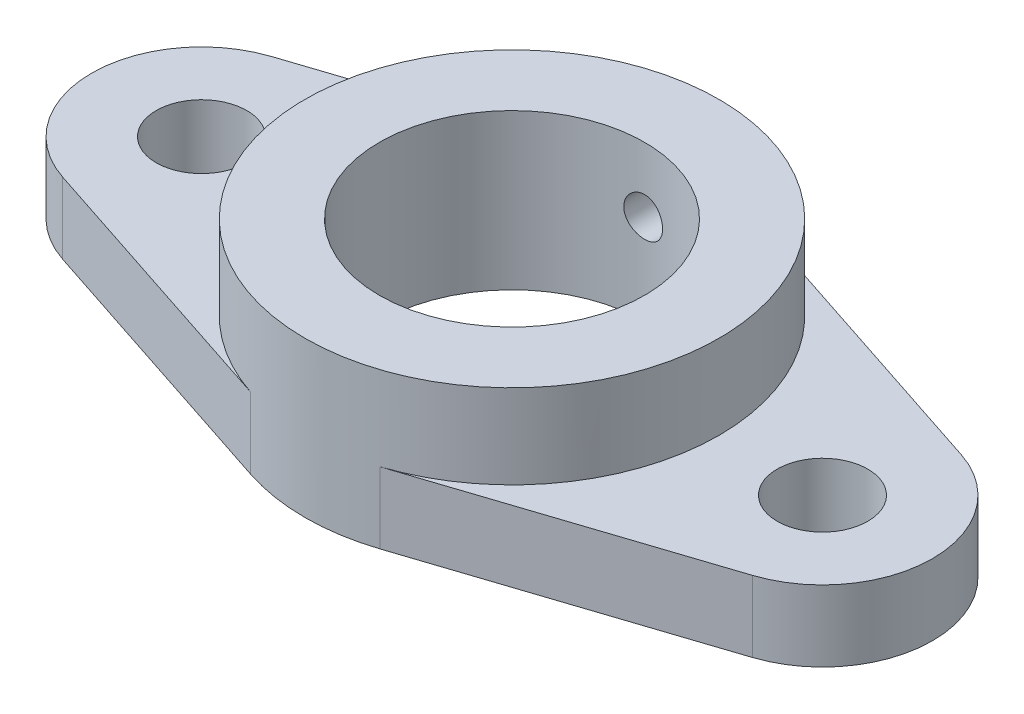
ISO-10303-21;
HEADER;
FILE_DESCRIPTION(('STEP AP214'),'2;1');
FILE_NAME('part.step','',(''),(''),'','','');
FILE_SCHEMA(('AUTOMOTIVE_DESIGN { 1 0 10303 214 1 1 1 1 }'));
ENDSEC;
DATA;
#1=APPLICATION_CONTEXT('core data for automotive mechanical design processes');
#2=APPLICATION_PROTOCOL_DEFINITION('international standard','automotive_design',2000,#1);
#3=PRODUCT_CONTEXT('',#1,'mechanical');
#4=PRODUCT('Part','Part','',(#3));
#5=PRODUCT_RELATED_PRODUCT_CATEGORY('part','',(#4));
#6=PRODUCT_DEFINITION_FORMATION('','',#4);
#7=PRODUCT_DEFINITION_CONTEXT('part definition',#1,'design');
#8=PRODUCT_DEFINITION('design','',#6,#7);
#9=PRODUCT_DEFINITION_SHAPE('','',#8);
#10=(LENGTH_UNIT() NAMED_UNIT(*) SI_UNIT(.MILLI.,.METRE.));
#11=(NAMED_UNIT(*) PLANE_ANGLE_UNIT() SI_UNIT($,.RADIAN.));
#12=(NAMED_UNIT(*) SI_UNIT($,.STERADIAN.) SOLID_ANGLE_UNIT());
#13=UNCERTAINTY_MEASURE_WITH_UNIT(LENGTH_MEASURE(1.E-05),#10,'distance_accuracy_value','');
#14=(GEOMETRIC_REPRESENTATION_CONTEXT(3) GLOBAL_UNCERTAINTY_ASSIGNED_CONTEXT((#13)) GLOBAL_UNIT_ASSIGNED_CONTEXT((#10,
#11,#12)) REPRESENTATION_CONTEXT('',''));
#15=CARTESIAN_POINT('',(0.,0.,0.));
#16=DIRECTION('',(0.,0.,1.));
#17=DIRECTION('',(1.,0.,0.));
#18=AXIS2_PLACEMENT_3D('',#15,#16,#17);
#19=CARTESIAN_POINT('',(-48.,11.,0.));
#20=DIRECTION('',(0.,1.,0.));
#21=DIRECTION('',(0.,0.,1.));
#22=AXIS2_PLACEMENT_3D('',#19,#20,#21);
#23=PLANE('',#22);
#24=CARTESIAN_POINT('',(-48.,11.,0.));
#25=DIRECTION('',(0.,1.,0.));
#26=DIRECTION('',(0.,0.,1.));
#27=AXIS2_PLACEMENT_3D('',#24,#25,#26);
#28=CIRCLE('',#27,7.);
#29=CARTESIAN_POINT('',(-48.,11.,7.));
#30=VERTEX_POINT('',#29);
#31=EDGE_CURVE('E156',#30,#30,#28,.T.);
#32=ORIENTED_EDGE('',*,*,#31,.F.);
#33=EDGE_LOOP('',(#32));
#34=FACE_BOUND('',#33,.T.);
#35=DIRECTION('',(0.949917759598166,0.,0.3125));
#36=VECTOR('',#35,1.);
#37=CARTESIAN_POINT('',(-53.3125,11.,16.1486019131688));
#38=LINE('',#37,#36);
#39=CARTESIAN_POINT('',(-53.3125,11.,16.1486019131688));
#40=VERTEX_POINT('',#39);
#41=CARTESIAN_POINT('',(-10.,11.,30.3973683071413));
#42=VERTEX_POINT('',#41);
#43=EDGE_CURVE('E103',#40,#42,#38,.T.);
#44=ORIENTED_EDGE('',*,*,#43,.T.);
#45=CARTESIAN_POINT('',(0.,11.,0.));
#46=DIRECTION('',(0.,1.,0.));
#47=DIRECTION('',(0.,0.,1.));
#48=AXIS2_PLACEMENT_3D('',#45,#46,#47);
#49=CIRCLE('',#48,32.);
#50=CARTESIAN_POINT('',(-9.99999999999999,11.,-30.3973683071413));
#51=VERTEX_POINT('',#50);
#52=EDGE_CURVE('E145',#42,#51,#49,.F.);
#53=ORIENTED_EDGE('',*,*,#52,.T.);
#54=DIRECTION('',(0.949917759598166,0.,-0.3125));
#55=VECTOR('',#54,1.);
#56=CARTESIAN_POINT('',(-53.3125,11.,-16.1486019131688));
#57=LINE('',#56,#55);
#58=CARTESIAN_POINT('',(-53.3125,11.,-16.1486019131688));
#59=VERTEX_POINT('',#58);
#60=EDGE_CURVE('E137',#59,#51,#57,.T.);
#61=ORIENTED_EDGE('',*,*,#60,.F.);
#62=CARTESIAN_POINT('',(-48.,11.,0.));
#63=DIRECTION('',(0.,1.,0.));
#64=DIRECTION('',(0.,0.,1.));
#65=AXIS2_PLACEMENT_3D('',#62,#63,#64);
#66=CIRCLE('',#65,17.);
#67=EDGE_CURVE('E172',#59,#40,#66,.T.);
#68=ORIENTED_EDGE('',*,*,#67,.T.);
#69=EDGE_LOOP('',(#44,#53,#61,#68));
#70=FACE_BOUND('',#69,.T.);
#71=ADVANCED_FACE('F39',(#34,#70),#23,.T.);
#72=CARTESIAN_POINT('',(48.,11.,0.));
#73=DIRECTION('',(0.,1.,0.));
#74=DIRECTION('',(0.,0.,1.));
#75=AXIS2_PLACEMENT_3D('',#72,#73,#74);
#76=CIRCLE('',#75,7.);
#77=CARTESIAN_POINT('',(48.,11.,7.));
#78=VERTEX_POINT('',#77);
#79=EDGE_CURVE('E165',#78,#78,#76,.T.);
#80=ORIENTED_EDGE('',*,*,#79,.F.);
#81=EDGE_LOOP('',(#80));
#82=FACE_BOUND('',#81,.T.);
#83=DIRECTION('',(0.949917759598166,0.,0.3125));
#84=VECTOR('',#83,1.);
#85=CARTESIAN_POINT('',(10.,11.,-30.3973683071413));
#86=LINE('',#85,#84);
#87=CARTESIAN_POINT('',(10.,11.,-30.3973683071413));
#88=VERTEX_POINT('',#87);
#89=CARTESIAN_POINT('',(53.3125,11.,-16.1486019131688));
#90=VERTEX_POINT('',#89);
#91=EDGE_CURVE('E120',#88,#90,#86,.T.);
#92=ORIENTED_EDGE('',*,*,#91,.F.);
#93=CARTESIAN_POINT('',(10.,11.,30.3973683071413));
#94=VERTEX_POINT('',#93);
#95=EDGE_CURVE('E132',#88,#94,#49,.F.);
#96=ORIENTED_EDGE('',*,*,#95,.T.);
#97=DIRECTION('',(0.949917759598166,0.,-0.3125));
#98=VECTOR('',#97,1.);
#99=CARTESIAN_POINT('',(10.,11.,30.3973683071413));
#100=LINE('',#99,#98);
#101=CARTESIAN_POINT('',(53.3125,11.,16.1486019131688));
#102=VERTEX_POINT('',#101);
#103=EDGE_CURVE('E178',#94,#102,#100,.T.);
#104=ORIENTED_EDGE('',*,*,#103,.T.);
#105=CARTESIAN_POINT('',(48.,11.,0.));
#106=DIRECTION('',(0.,1.,0.));
#107=DIRECTION('',(0.,0.,1.));
#108=AXIS2_PLACEMENT_3D('',#105,#106,#107);
#109=CIRCLE('',#108,17.);
#110=EDGE_CURVE('E134',#102,#90,#109,.T.);
#111=ORIENTED_EDGE('',*,*,#110,.T.);
#112=EDGE_LOOP('',(#92,#96,#104,#111));
#113=FACE_BOUND('',#112,.T.);
#114=ADVANCED_FACE('F131',(#82,#113),#23,.T.);
#115=CARTESIAN_POINT('',(-48.,11.,0.));
#116=DIRECTION('',(0.,-1.,0.));
#117=DIRECTION('',(0.,0.,-1.));
#118=AXIS2_PLACEMENT_3D('',#115,#116,#117);
#119=CYLINDRICAL_SURFACE('',#118,17.);
#120=CARTESIAN_POINT('',(-48.,0.,0.));
#121=DIRECTION('',(0.,1.,0.));
#122=DIRECTION('',(0.,0.,1.));
#123=AXIS2_PLACEMENT_3D('',#120,#121,#122);
#124=CIRCLE('',#123,17.);
#125=CARTESIAN_POINT('',(-53.3125,0.,-16.1486019131688));
#126=VERTEX_POINT('',#125);
#127=CARTESIAN_POINT('',(-53.3125,0.,16.1486019131688));
#128=VERTEX_POINT('',#127);
#129=EDGE_CURVE('E160',#126,#128,#124,.T.);
#130=ORIENTED_EDGE('',*,*,#129,.T.);
#131=DIRECTION('',(0.,-1.,0.));
#132=VECTOR('',#131,1.);
#133=CARTESIAN_POINT('',(-53.3125,11.,16.1486019131688));
#134=LINE('',#133,#132);
#135=EDGE_CURVE('E11',#40,#128,#134,.T.);
#136=ORIENTED_EDGE('',*,*,#135,.F.);
#137=ORIENTED_EDGE('',*,*,#67,.F.);
#138=DIRECTION('',(0.,-1.,0.));
#139=VECTOR('',#138,1.);
#140=CARTESIAN_POINT('',(-53.3125,11.,-16.1486019131688));
#141=LINE('',#140,#139);
#142=EDGE_CURVE('E63',#59,#126,#141,.T.);
#143=ORIENTED_EDGE('',*,*,#142,.T.);
#144=EDGE_LOOP('',(#130,#136,#137,#143));
#145=FACE_BOUND('',#144,.T.);
#146=ADVANCED_FACE('F41',(#145),#119,.T.);
#147=CARTESIAN_POINT('',(-53.3125,11.,16.1486019131688));
#148=DIRECTION('',(0.3125,0.,-0.949917759598167));
#149=DIRECTION('',(-0.949917759598167,0.,-0.3125));
#150=AXIS2_PLACEMENT_3D('',#147,#148,#149);
#151=PLANE('',#150);
#152=DIRECTION('',(0.949917759598166,0.,0.3125));
#153=VECTOR('',#152,1.);
#154=CARTESIAN_POINT('',(-53.3125,0.,16.1486019131688));
#155=LINE('',#154,#153);
#156=CARTESIAN_POINT('',(-10.,0.,30.3973683071413));
#157=VERTEX_POINT('',#156);
#158=EDGE_CURVE('E187',#128,#157,#155,.T.);
#159=ORIENTED_EDGE('',*,*,#158,.T.);
#160=DIRECTION('',(0.,-1.,0.));
#161=VECTOR('',#160,1.);
#162=CARTESIAN_POINT('',(-10.,11.,30.3973683071413));
#163=LINE('',#162,#161);
#164=EDGE_CURVE('E55',#42,#157,#163,.T.);
#165=ORIENTED_EDGE('',*,*,#164,.F.);
#166=ORIENTED_EDGE('',*,*,#43,.F.);
#167=ORIENTED_EDGE('',*,*,#135,.T.);
#168=EDGE_LOOP('',(#159,#165,#166,#167));
#169=FACE_BOUND('',#168,.T.);
#170=ADVANCED_FACE('F239',(#169),#151,.F.);
#171=CARTESIAN_POINT('',(10.,11.,30.3973683071413));
#172=DIRECTION('',(-0.3125,0.,-0.949917759598167));
#173=DIRECTION('',(-0.949917759598167,0.,0.3125));
#174=AXIS2_PLACEMENT_3D('',#171,#172,#173);
#175=PLANE('',#174);
#176=DIRECTION('',(0.949917759598166,0.,-0.3125));
#177=VECTOR('',#176,1.);
#178=CARTESIAN_POINT('',(10.,0.,30.3973683071413));
#179=LINE('',#178,#177);
#180=CARTESIAN_POINT('',(10.,0.,30.3973683071413));
#181=VERTEX_POINT('',#180);
#182=CARTESIAN_POINT('',(53.3125,0.,16.1486019131688));
#183=VERTEX_POINT('',#182);
#184=EDGE_CURVE('E193',#181,#183,#179,.T.);
#185=ORIENTED_EDGE('',*,*,#184,.T.);
#186=DIRECTION('',(0.,-1.,0.));
#187=VECTOR('',#186,1.);
#188=CARTESIAN_POINT('',(53.3125,11.,16.1486019131688));
#189=LINE('',#188,#187);
#190=EDGE_CURVE('E214',#102,#183,#189,.T.);
#191=ORIENTED_EDGE('',*,*,#190,.F.);
#192=ORIENTED_EDGE('',*,*,#103,.F.);
#193=DIRECTION('',(0.,-1.,0.));
#194=VECTOR('',#193,1.);
#195=CARTESIAN_POINT('',(10.,11.,30.3973683071413));
#196=LINE('',#195,#194);
#197=EDGE_CURVE('E143',#94,#181,#196,.T.);
#198=ORIENTED_EDGE('',*,*,#197,.T.);
#199=EDGE_LOOP('',(#185,#191,#192,#198));
#200=FACE_BOUND('',#199,.T.);
#201=ADVANCED_FACE('F231',(#200),#175,.F.);
#202=CARTESIAN_POINT('',(48.,11.,0.));
#203=DIRECTION('',(0.,-1.,0.));
#204=DIRECTION('',(0.,0.,-1.));
#205=AXIS2_PLACEMENT_3D('',#202,#203,#204);
#206=CYLINDRICAL_SURFACE('',#205,17.);
#207=CARTESIAN_POINT('',(48.,0.,0.));
#208=DIRECTION('',(0.,1.,0.));
#209=DIRECTION('',(0.,0.,1.));
#210=AXIS2_PLACEMENT_3D('',#207,#208,#209);
#211=CIRCLE('',#210,17.);
#212=CARTESIAN_POINT('',(53.3125,0.,-16.1486019131688));
#213=VERTEX_POINT('',#212);
#214=EDGE_CURVE('E196',#183,#213,#211,.T.);
#215=ORIENTED_EDGE('',*,*,#214,.T.);
#216=DIRECTION('',(0.,-1.,0.));
#217=VECTOR('',#216,1.);
#218=CARTESIAN_POINT('',(53.3125,11.,-16.1486019131688));
#219=LINE('',#218,#217);
#220=EDGE_CURVE('E127',#90,#213,#219,.T.);
#221=ORIENTED_EDGE('',*,*,#220,.F.);
#222=ORIENTED_EDGE('',*,*,#110,.F.);
#223=ORIENTED_EDGE('',*,*,#190,.T.);
#224=EDGE_LOOP('',(#215,#221,#222,#223));
#225=FACE_BOUND('',#224,.T.);
#226=ADVANCED_FACE('F234',(#225),#206,.T.);
#227=CARTESIAN_POINT('',(10.,11.,-30.3973683071413));
#228=DIRECTION('',(0.3125,0.,-0.949917759598167));
#229=DIRECTION('',(-0.949917759598167,0.,-0.3125));
#230=AXIS2_PLACEMENT_3D('',#227,#228,#229);
#231=PLANE('',#230);
#232=DIRECTION('',(0.949917759598166,0.,0.3125));
#233=VECTOR('',#232,1.);
#234=CARTESIAN_POINT('',(10.,0.,-30.3973683071413));
#235=LINE('',#234,#233);
#236=CARTESIAN_POINT('',(10.,0.,-30.3973683071413));
#237=VERTEX_POINT('',#236);
#238=EDGE_CURVE('E122',#237,#213,#235,.T.);
#239=ORIENTED_EDGE('',*,*,#238,.F.);
#240=DIRECTION('',(0.,-1.,0.));
#241=VECTOR('',#240,1.);
#242=CARTESIAN_POINT('',(10.,11.,-30.3973683071413));
#243=LINE('',#242,#241);
#244=EDGE_CURVE('E117',#88,#237,#243,.T.);
#245=ORIENTED_EDGE('',*,*,#244,.F.);
#246=ORIENTED_EDGE('',*,*,#91,.T.);
#247=ORIENTED_EDGE('',*,*,#220,.T.);
#248=EDGE_LOOP('',(#239,#245,#246,#247));
#249=FACE_BOUND('',#248,.T.);
#250=ADVANCED_FACE('F119',(#249),#231,.T.);
#251=CARTESIAN_POINT('',(0.,11.,0.));
#252=DIRECTION('',(0.,-1.,0.));
#253=DIRECTION('',(0.,0.,-1.));
#254=AXIS2_PLACEMENT_3D('',#251,#252,#253);
#255=CYLINDRICAL_SURFACE('',#254,32.);
#256=CARTESIAN_POINT('',(0.,17.,-32.));
#257=CARTESIAN_POINT('',(-0.168115399314887,16.9999926940509,-31.9999981748754));
#258=CARTESIAN_POINT('',(-0.336343255178758,16.985821045742,-31.9986610862948));
#259=CARTESIAN_POINT('',(-0.668138761511169,16.9294994002667,-31.9934557411232));
#260=CARTESIAN_POINT('',(-0.831701008118701,16.8873182327026,-31.9895846646516));
#261=CARTESIAN_POINT('',(-1.14931225521735,16.7762130396953,-31.9797485072184));
#262=CARTESIAN_POINT('',(-1.30336679608948,16.7073047626708,-31.9737846595775));
#263=CARTESIAN_POINT('',(-1.59768816097209,16.5447310459498,-31.9604305942591));
#264=CARTESIAN_POINT('',(-1.73795780066335,16.4510706765535,-31.9530406687878));
#265=CARTESIAN_POINT('',(-2.00120902716598,16.2413308034907,-31.9376365207949));
#266=CARTESIAN_POINT('',(-2.12414061049845,16.1251886584077,-31.9296205921512));
#267=CARTESIAN_POINT('',(-2.3487966400369,15.8739152853397,-31.913882071679));
#268=CARTESIAN_POINT('',(-2.45052012526133,15.7387831973465,-31.9061594931557));
#269=CARTESIAN_POINT('',(-2.63004671485864,15.4530565035534,-31.8918643063806));
#270=CARTESIAN_POINT('',(-2.70780503711839,15.3024336429719,-31.8852938607966));
#271=CARTESIAN_POINT('',(-2.83690804710167,14.9901973377456,-31.8740674663671));
#272=CARTESIAN_POINT('',(-2.88825331339577,14.8285841339289,-31.8694114755864));
#273=CARTESIAN_POINT('',(-2.96292560343407,14.4994616233725,-31.8625562110262));
#274=CARTESIAN_POINT('',(-2.98633505242779,14.3319711705288,-31.8603497113192));
#275=CARTESIAN_POINT('',(-3.00472593058046,13.9954250694195,-31.8586206848802));
#276=CARTESIAN_POINT('',(-2.99970802214655,13.8263694577165,-31.8590980956084));
#277=CARTESIAN_POINT('',(-2.96145463264386,13.4920587685569,-31.8626763607513));
#278=CARTESIAN_POINT('',(-2.92830898225648,13.3267933103237,-31.8657688633193));
#279=CARTESIAN_POINT('',(-2.83488068245928,13.004181558488,-31.8742158003922));
#280=CARTESIAN_POINT('',(-2.77459770653281,12.8468353601956,-31.8795702621131));
#281=CARTESIAN_POINT('',(-2.62850624899421,12.544243844256,-31.8919474207369));
#282=CARTESIAN_POINT('',(-2.5426577351709,12.3990179654115,-31.8989727304643));
#283=CARTESIAN_POINT('',(-2.34790092714585,12.1250021769774,-31.9138977267856));
#284=CARTESIAN_POINT('',(-2.23899204028817,11.9962126899426,-31.9217974358492));
#285=CARTESIAN_POINT('',(-2.00070344799441,11.7582034182068,-31.9376183312586));
#286=CARTESIAN_POINT('',(-1.87124613096329,11.6490613187532,-31.9455394823666));
#287=CARTESIAN_POINT('',(-1.59580549512091,11.4540465012955,-31.9604817756881));
#288=CARTESIAN_POINT('',(-1.44982216101204,11.3681738048313,-31.9675029170684));
#289=CARTESIAN_POINT('',(-1.14542091568032,11.222139201156,-31.9798560070141));
#290=CARTESIAN_POINT('',(-0.987001198142366,11.1619810370454,-31.9851877096294));
#291=CARTESIAN_POINT('',(-0.662248644546849,11.0691390927822,-31.9935585656847));
#292=CARTESIAN_POINT('',(-0.495916016528199,11.0364545907387,-31.9965977793613));
#293=CARTESIAN_POINT('',(-0.16073221037836,10.9995858596237,-32.0000334878535));
#294=CARTESIAN_POINT('',(0.00810707410710639,10.9952943897314,-32.0004399265695));
#295=CARTESIAN_POINT('',(0.344102556874818,11.0150521665494,-31.9985909127794));
#296=CARTESIAN_POINT('',(0.511258775075278,11.0391010774675,-31.9963354918125));
#297=CARTESIAN_POINT('',(0.838835131324555,11.1147680197617,-31.9894226616346));
#298=CARTESIAN_POINT('',(0.99926692156231,11.1663360383907,-31.9847696103615));
#299=CARTESIAN_POINT('',(1.30920205212962,11.2955260978902,-31.973583800311));
#300=CARTESIAN_POINT('',(1.45870517567794,11.3731486554083,-31.9670510042597));
#301=CARTESIAN_POINT('',(1.74302525434123,11.5525117323352,-31.9528122825607));
#302=CARTESIAN_POINT('',(1.87779744027399,11.654322942941,-31.9451029425442));
#303=CARTESIAN_POINT('',(2.12837727907027,11.8790716213687,-31.9293877727314));
#304=CARTESIAN_POINT('',(2.24418451422764,12.002009554388,-31.9213819364095));
#305=CARTESIAN_POINT('',(2.45391768480183,12.2659888375891,-31.905946348933));
#306=CARTESIAN_POINT('',(2.54777339578275,12.4070861080545,-31.8985184960202));
#307=CARTESIAN_POINT('',(2.71045704222343,12.7031020190287,-31.8851080290736));
#308=CARTESIAN_POINT('',(2.77928528378845,12.8580204904646,-31.8791253973641));
#309=CARTESIAN_POINT('',(2.88984182928888,13.177037309976,-31.8692941729656));
#310=CARTESIAN_POINT('',(2.93161239307897,13.3411209059928,-31.8654422538185));
#311=CARTESIAN_POINT('',(2.98700517908095,13.6740105572983,-31.8602979622515));
#312=CARTESIAN_POINT('',(3.0006281023813,13.842816494859,-31.8590055260811));
#313=CARTESIAN_POINT('',(2.99932982880456,14.1796611223319,-31.859127723702));
#314=CARTESIAN_POINT('',(2.98451895285188,14.3477002521792,-31.8605318948739));
#315=CARTESIAN_POINT('',(2.92700431630763,14.6788924802069,-31.8658668161845));
#316=CARTESIAN_POINT('',(2.88430051954693,14.8420455720511,-31.8697975695994));
#317=CARTESIAN_POINT('',(2.77224172761467,15.1588366848905,-31.8797399174344));
#318=CARTESIAN_POINT('',(2.70288948956702,15.3124756883316,-31.8857512965807));
#319=CARTESIAN_POINT('',(2.53951415830947,15.6059492280781,-31.8991779895574));
#320=CARTESIAN_POINT('',(2.44549130145603,15.745783896618,-31.9065932899374));
#321=CARTESIAN_POINT('',(2.23502898457461,16.0082446393722,-31.9220266996351));
#322=CARTESIAN_POINT('',(2.11850745840755,16.1308047814331,-31.9300469482188));
#323=CARTESIAN_POINT('',(1.86651366658995,16.3546836683372,-31.9457669927199));
#324=CARTESIAN_POINT('',(1.7310368506569,16.4559972982465,-31.9534667111154));
#325=CARTESIAN_POINT('',(1.44465006468669,16.6346817143785,-31.9676957677813));
#326=CARTESIAN_POINT('',(1.29370599046959,16.7119980085943,-31.974222428397));
#327=CARTESIAN_POINT('',(0.981015813780893,16.8400863585311,-31.9853401166149));
#328=CARTESIAN_POINT('',(0.819282221975795,16.890888574647,-31.9899333423891));
#329=CARTESIAN_POINT('',(0.547181252086886,16.9517315039179,-31.9955025563841));
#330=CARTESIAN_POINT('',(0.438557597027561,16.9698077265454,-31.9971813074252));
#331=CARTESIAN_POINT('',(0.219972009593135,16.993944343855,-31.9994306244394));
#332=CARTESIAN_POINT('',(0.110010081927779,17.0000047808116,-32.0000011943112));
#333=CARTESIAN_POINT('',(0.,17.,-32.));
#334=B_SPLINE_CURVE_WITH_KNOTS('',3,(#256,#257,#258,#259,#260,#261,#262,#263,#264,#265,#266,
#267,#268,#269,#270,#271,#272,#273,#274,#275,#276,#277,#278,#279,#280,#281,#282,#283,#284,#285,
#286,#287,#288,#289,#290,#291,#292,#293,#294,#295,#296,#297,#298,#299,#300,#301,#302,#303,#304,
#305,#306,#307,#308,#309,#310,#311,#312,#313,#314,#315,#316,#317,#318,#319,#320,#321,#322,#323,
#324,#325,#326,#327,#328,#329,#330,#331,#332,#333),.UNSPECIFIED.,.T.,.F.,(4,2,2,2,2,2,2,2,2,2,2,
2,2,2,2,2,2,2,2,2,2,2,2,2,2,2,2,2,2,2,2,2,2,2,2,2,2,2,4),(0.,0.503944505741273,1.00845076818204,
1.51266021082264,2.01676644949248,2.52229805099994,3.02785255418417,3.5343461046456,
4.04082856003567,4.54581290342575,5.05078547984558,5.55415138442576,6.05752334567305,
6.56168770210196,7.0658650172227,7.5719940288513,8.07812350899118,8.58432663810278,
9.09051646593732,9.59479331191456,10.0990641830065,10.6024217065707,11.1057892120358,
11.6106463050567,12.1155145161427,12.6219763943921,13.1284320780134,13.6340948377097,
14.1397450024389,14.6434372482809,15.1471301472689,15.6507709467758,16.1544069213364,
16.6599158999591,17.1655464366175,17.6723168740504,18.1785095846657,18.5082781343565,
18.8380455238376),.UNSPECIFIED.);
#335=CARTESIAN_POINT('',(0.,17.,-32.));
#336=VERTEX_POINT('',#335);
#337=EDGE_CURVE('E269',#336,#336,#334,.T.);
#338=ORIENTED_EDGE('',*,*,#337,.T.);
#339=EDGE_LOOP('',(#338));
#340=FACE_BOUND('',#339,.T.);
#341=CARTESIAN_POINT('',(0.,0.,0.));
#342=DIRECTION('',(0.,1.,0.));
#343=DIRECTION('',(0.,0.,1.));
#344=AXIS2_PLACEMENT_3D('',#341,#342,#343);
#345=CIRCLE('',#344,32.);
#346=CARTESIAN_POINT('',(-9.99999999999999,0.,-30.3973683071413));
#347=VERTEX_POINT('',#346);
#348=EDGE_CURVE('E202',#237,#347,#345,.T.);
#349=ORIENTED_EDGE('',*,*,#348,.T.);
#350=DIRECTION('',(0.,-1.,0.));
#351=VECTOR('',#350,1.);
#352=CARTESIAN_POINT('',(-9.99999999999999,11.,-30.3973683071413));
#353=LINE('',#352,#351);
#354=EDGE_CURVE('E91',#51,#347,#353,.T.);
#355=ORIENTED_EDGE('',*,*,#354,.F.);
#356=ORIENTED_EDGE('',*,*,#52,.F.);
#357=ORIENTED_EDGE('',*,*,#164,.T.);
#358=CARTESIAN_POINT('',(0.,0.,0.));
#359=DIRECTION('',(0.,1.,0.));
#360=DIRECTION('',(0.,0.,1.));
#361=AXIS2_PLACEMENT_3D('',#358,#359,#360);
#362=CIRCLE('',#361,32.);
#363=EDGE_CURVE('E190',#157,#181,#362,.T.);
#364=ORIENTED_EDGE('',*,*,#363,.T.);
#365=ORIENTED_EDGE('',*,*,#197,.F.);
#366=ORIENTED_EDGE('',*,*,#95,.F.);
#367=ORIENTED_EDGE('',*,*,#244,.T.);
#368=EDGE_LOOP('',(#349,#355,#356,#357,#364,#365,#366,#367));
#369=FACE_BOUND('',#368,.T.);
#370=CARTESIAN_POINT('',(0.,24.,0.));
#371=DIRECTION('',(0.,1.,0.));
#372=DIRECTION('',(0.,0.,1.));
#373=AXIS2_PLACEMENT_3D('',#370,#371,#372);
#374=CIRCLE('',#373,32.);
#375=CARTESIAN_POINT('',(0.,24.,32.));
#376=VERTEX_POINT('',#375);
#377=EDGE_CURVE('E146',#376,#376,#374,.T.);
#378=ORIENTED_EDGE('',*,*,#377,.F.);
#379=EDGE_LOOP('',(#378));
#380=FACE_BOUND('',#379,.T.);
#381=ADVANCED_FACE('F140',(#340,#369,#380),#255,.T.);
#382=CARTESIAN_POINT('',(-53.3125,11.,-16.1486019131688));
#383=DIRECTION('',(-0.3125,0.,-0.949917759598167));
#384=DIRECTION('',(-0.949917759598167,0.,0.3125));
#385=AXIS2_PLACEMENT_3D('',#382,#383,#384);
#386=PLANE('',#385);
#387=DIRECTION('',(0.949917759598166,0.,-0.3125));
#388=VECTOR('',#387,1.);
#389=CARTESIAN_POINT('',(-53.3125,0.,-16.1486019131688));
#390=LINE('',#389,#388);
#391=EDGE_CURVE('E175',#126,#347,#390,.T.);
#392=ORIENTED_EDGE('',*,*,#391,.F.);
#393=ORIENTED_EDGE('',*,*,#142,.F.);
#394=ORIENTED_EDGE('',*,*,#60,.T.);
#395=ORIENTED_EDGE('',*,*,#354,.T.);
#396=EDGE_LOOP('',(#392,#393,#394,#395));
#397=FACE_BOUND('',#396,.T.);
#398=ADVANCED_FACE('F236',(#397),#386,.T.);
#399=CARTESIAN_POINT('',(-48.,0.,0.));
#400=DIRECTION('',(0.,1.,0.));
#401=DIRECTION('',(0.,0.,1.));
#402=AXIS2_PLACEMENT_3D('',#399,#400,#401);
#403=PLANE('',#402);
#404=CARTESIAN_POINT('',(0.,0.,0.));
#405=DIRECTION('',(0.,1.,0.));
#406=DIRECTION('',(0.,0.,1.));
#407=AXIS2_PLACEMENT_3D('',#404,#405,#406);
#408=CIRCLE('',#407,20.5);
#409=CARTESIAN_POINT('',(0.,0.,20.5));
#410=VERTEX_POINT('',#409);
#411=EDGE_CURVE('E276',#410,#410,#408,.T.);
#412=ORIENTED_EDGE('',*,*,#411,.T.);
#413=EDGE_LOOP('',(#412));
#414=FACE_BOUND('',#413,.T.);
#415=ORIENTED_EDGE('',*,*,#363,.F.);
#416=ORIENTED_EDGE('',*,*,#158,.F.);
#417=ORIENTED_EDGE('',*,*,#129,.F.);
#418=ORIENTED_EDGE('',*,*,#391,.T.);
#419=ORIENTED_EDGE('',*,*,#348,.F.);
#420=ORIENTED_EDGE('',*,*,#238,.T.);
#421=ORIENTED_EDGE('',*,*,#214,.F.);
#422=ORIENTED_EDGE('',*,*,#184,.F.);
#423=EDGE_LOOP('',(#415,#416,#417,#418,#419,#420,#421,#422));
#424=FACE_BOUND('',#423,.T.);
#425=CARTESIAN_POINT('',(48.,0.,0.));
#426=DIRECTION('',(0.,1.,0.));
#427=DIRECTION('',(0.,0.,1.));
#428=AXIS2_PLACEMENT_3D('',#425,#426,#427);
#429=CIRCLE('',#428,7.);
#430=CARTESIAN_POINT('',(48.,0.,7.));
#431=VERTEX_POINT('',#430);
#432=EDGE_CURVE('E150',#431,#431,#429,.T.);
#433=ORIENTED_EDGE('',*,*,#432,.T.);
#434=EDGE_LOOP('',(#433));
#435=FACE_BOUND('',#434,.T.);
#436=CARTESIAN_POINT('',(-48.,0.,0.));
#437=DIRECTION('',(0.,1.,0.));
#438=DIRECTION('',(0.,0.,1.));
#439=AXIS2_PLACEMENT_3D('',#436,#437,#438);
#440=CIRCLE('',#439,7.);
#441=CARTESIAN_POINT('',(-48.,0.,7.));
#442=VERTEX_POINT('',#441);
#443=EDGE_CURVE('E161',#442,#442,#440,.T.);
#444=ORIENTED_EDGE('',*,*,#443,.T.);
#445=EDGE_LOOP('',(#444));
#446=FACE_BOUND('',#445,.T.);
#447=ADVANCED_FACE('F226',(#414,#424,#435,#446),#403,.F.);
#448=CARTESIAN_POINT('',(48.,11.,0.));
#449=DIRECTION('',(0.,-1.,0.));
#450=DIRECTION('',(0.,0.,-1.));
#451=AXIS2_PLACEMENT_3D('',#448,#449,#450);
#452=CYLINDRICAL_SURFACE('',#451,7.);
#453=ORIENTED_EDGE('',*,*,#79,.T.);
#454=EDGE_LOOP('',(#453));
#455=FACE_BOUND('',#454,.T.);
#456=ORIENTED_EDGE('',*,*,#432,.F.);
#457=EDGE_LOOP('',(#456));
#458=FACE_BOUND('',#457,.T.);
#459=ADVANCED_FACE('F256',(#455,#458),#452,.F.);
#460=CARTESIAN_POINT('',(-48.,11.,0.));
#461=DIRECTION('',(0.,-1.,0.));
#462=DIRECTION('',(0.,0.,-1.));
#463=AXIS2_PLACEMENT_3D('',#460,#461,#462);
#464=CYLINDRICAL_SURFACE('',#463,7.);
#465=ORIENTED_EDGE('',*,*,#31,.T.);
#466=EDGE_LOOP('',(#465));
#467=FACE_BOUND('',#466,.T.);
#468=ORIENTED_EDGE('',*,*,#443,.F.);
#469=EDGE_LOOP('',(#468));
#470=FACE_BOUND('',#469,.T.);
#471=ADVANCED_FACE('F289',(#467,#470),#464,.F.);
#472=CARTESIAN_POINT('',(0.,24.,0.));
#473=DIRECTION('',(0.,1.,0.));
#474=DIRECTION('',(0.,0.,1.));
#475=AXIS2_PLACEMENT_3D('',#472,#473,#474);
#476=PLANE('',#475);
#477=CARTESIAN_POINT('',(0.,24.,0.));
#478=DIRECTION('',(0.,1.,0.));
#479=DIRECTION('',(0.,0.,1.));
#480=AXIS2_PLACEMENT_3D('',#477,#478,#479);
#481=CIRCLE('',#480,20.5);
#482=CARTESIAN_POINT('',(0.,24.,20.5));
#483=VERTEX_POINT('',#482);
#484=EDGE_CURVE('E152',#483,#483,#481,.T.);
#485=ORIENTED_EDGE('',*,*,#484,.F.);
#486=EDGE_LOOP('',(#485));
#487=FACE_BOUND('',#486,.T.);
#488=ORIENTED_EDGE('',*,*,#377,.T.);
#489=EDGE_LOOP('',(#488));
#490=FACE_BOUND('',#489,.T.);
#491=ADVANCED_FACE('F286',(#487,#490),#476,.T.);
#492=CARTESIAN_POINT('',(0.,24.,0.));
#493=DIRECTION('',(0.,-1.,0.));
#494=DIRECTION('',(0.,0.,-1.));
#495=AXIS2_PLACEMENT_3D('',#492,#493,#494);
#496=CYLINDRICAL_SURFACE('',#495,20.5);
#497=CARTESIAN_POINT('',(0.,17.,-20.5));
#498=CARTESIAN_POINT('',(-0.167551274112497,16.9999930544583,-20.4999973607985));
#499=CARTESIAN_POINT('',(-0.335200951525567,16.9859159066342,-20.4979242926436));
#500=CARTESIAN_POINT('',(-0.665817543816577,16.9299916360489,-20.489853911555));
#501=CARTESIAN_POINT('',(-0.82877968207747,16.8881171655623,-20.483852734127));
#502=CARTESIAN_POINT('',(-1.1451883993056,16.777873484093,-20.4686007945372));
#503=CARTESIAN_POINT('',(-1.29864194932962,16.7095239559293,-20.4593524469532));
#504=CARTESIAN_POINT('',(-1.59187723915038,16.5483176943776,-20.4386291513216));
#505=CARTESIAN_POINT('',(-1.7316609434717,16.4554644895834,-20.427154523927));
#506=CARTESIAN_POINT('',(-1.99465435493976,16.2471491999732,-20.4031598936824));
#507=CARTESIAN_POINT('',(-2.11774746913732,16.1315406470551,-20.3906334371147));
#508=CARTESIAN_POINT('',(-2.34285986406966,15.8813114831825,-20.3659977073553));
#509=CARTESIAN_POINT('',(-2.44487795558532,15.7466898000783,-20.3538884577378));
#510=CARTESIAN_POINT('',(-2.62539534957976,15.4614762186887,-20.3313954798366));
#511=CARTESIAN_POINT('',(-2.70378237917224,15.3108125460583,-20.3210200899989));
#512=CARTESIAN_POINT('',(-2.83409512433933,14.9982809463099,-20.3032572917858));
#513=CARTESIAN_POINT('',(-2.8860222121045,14.8364136006996,-20.2958697284684));
#514=CARTESIAN_POINT('',(-2.96158010934644,14.5072934187184,-20.2849822457023));
#515=CARTESIAN_POINT('',(-2.98541014068461,14.3400872402252,-20.2814549679236));
#516=CARTESIAN_POINT('',(-3.00471453872236,14.0040149618666,-20.2786042824574));
#517=CARTESIAN_POINT('',(-3.00019045620103,13.8351489532871,-20.2792806448591));
#518=CARTESIAN_POINT('',(-2.96307796924889,13.5019548276822,-20.284735796961));
#519=CARTESIAN_POINT('',(-2.93071106241699,13.337601433049,-20.2894822073285));
#520=CARTESIAN_POINT('',(-2.83917825706707,13.0166837553778,-20.3024920891436));
#521=CARTESIAN_POINT('',(-2.78001163394209,12.8601196830734,-20.3107556556871));
#522=CARTESIAN_POINT('',(-2.63632734168323,12.5585487802043,-20.3299046732836));
#523=CARTESIAN_POINT('',(-2.5517154708059,12.4135874742903,-20.3407998368415));
#524=CARTESIAN_POINT('',(-2.35960963714995,12.1398365894473,-20.363977348404));
#525=CARTESIAN_POINT('',(-2.25211424393064,12.0110480222708,-20.3762597831039));
#526=CARTESIAN_POINT('',(-2.01607508554962,11.7720144235184,-20.4009711243691));
#527=CARTESIAN_POINT('',(-1.8873408063892,11.6619574613913,-20.4134003127551));
#528=CARTESIAN_POINT('',(-1.61312853035604,11.4649824710012,-20.4368960684613));
#529=CARTESIAN_POINT('',(-1.46765046641094,11.3780645354333,-20.4479626303228));
#530=CARTESIAN_POINT('',(-1.16392002425276,11.2298267157985,-20.4674969996145));
#531=CARTESIAN_POINT('',(-1.00566067672941,11.1685209113792,-20.4759633769809));
#532=CARTESIAN_POINT('',(-0.680941593234531,11.0734088577621,-20.4893313588088));
#533=CARTESIAN_POINT('',(-0.514482385421754,11.0396008398626,-20.4942331925455));
#534=CARTESIAN_POINT('',(-0.179712382685185,11.0006931289909,-20.499889508573));
#535=CARTESIAN_POINT('',(-0.011432254973537,10.9953347983957,-20.5006813535053));
#536=CARTESIAN_POINT('',(0.323624059788037,11.0127926831767,-20.4981300472792));
#537=CARTESIAN_POINT('',(0.490400290944023,11.0356080695534,-20.4947870177876));
#538=CARTESIAN_POINT('',(0.816934415549133,11.1085506989963,-20.4843647103456));
#539=CARTESIAN_POINT('',(0.97672095824814,11.1585523569885,-20.477302617027));
#540=CARTESIAN_POINT('',(1.28564244930157,11.2843160256681,-20.4602316494586));
#541=CARTESIAN_POINT('',(1.43477691808456,11.3600791952918,-20.4502226426384));
#542=CARTESIAN_POINT('',(1.71930098754809,11.5358250073486,-20.4282777447219));
#543=CARTESIAN_POINT('',(1.85458791963713,11.6359722250383,-20.4163289522261));
#544=CARTESIAN_POINT('',(2.10652667196153,11.8574136143587,-20.391875752318));
#545=CARTESIAN_POINT('',(2.2231774633506,11.978708952742,-20.3793713142787));
#546=CARTESIAN_POINT('',(2.43547007233669,12.2401530111999,-20.3550981721665));
#547=CARTESIAN_POINT('',(2.53093880939075,12.3804429765501,-20.3433360538298));
#548=CARTESIAN_POINT('',(2.69695540248555,12.6752197279695,-20.3219946608985));
#549=CARTESIAN_POINT('',(2.76750390603306,12.8297061450384,-20.3124153295905));
#550=CARTESIAN_POINT('',(2.88140726833885,13.1479677463092,-20.2965713903996));
#551=CARTESIAN_POINT('',(2.9248542281834,13.3117093854325,-20.290295567453));
#552=CARTESIAN_POINT('',(2.98361492696057,13.6442636784939,-20.2817390414581));
#553=CARTESIAN_POINT('',(2.99893050717304,13.8130759998061,-20.2794580769352));
#554=CARTESIAN_POINT('',(3.00095145966441,14.1492551143776,-20.2791589660804));
#555=CARTESIAN_POINT('',(2.98792892817569,14.3166202996275,-20.2811002782959));
#556=CARTESIAN_POINT('',(2.93422532266822,14.6467534747819,-20.2889390251283));
#557=CARTESIAN_POINT('',(2.8935442846211,14.809521470665,-20.2948364546002));
#558=CARTESIAN_POINT('',(2.78577296430281,15.125770650842,-20.309909026915));
#559=CARTESIAN_POINT('',(2.71870078250079,15.2792581171611,-20.3190819228685));
#560=CARTESIAN_POINT('',(2.56007807316654,15.5728452808861,-20.3396747456555));
#561=CARTESIAN_POINT('',(2.46852679761385,15.7129445690048,-20.351094741152));
#562=CARTESIAN_POINT('',(2.26255269742272,15.9771623600459,-20.3750257118928));
#563=CARTESIAN_POINT('',(2.1479281096326,16.1011227751174,-20.387545719873));
#564=CARTESIAN_POINT('',(1.89948729697265,16.3281467500432,-20.4121899227922));
#565=CARTESIAN_POINT('',(1.76566660901242,16.4312054367606,-20.424314024876));
#566=CARTESIAN_POINT('',(1.48181189622495,16.6139788232111,-20.4468724483872));
#567=CARTESIAN_POINT('',(1.33169679196188,16.6935687071446,-20.4572976074909));
#568=CARTESIAN_POINT('',(1.0201499414528,16.826287906602,-20.4751933643125));
#569=CARTESIAN_POINT('',(0.858730209076412,16.879444840875,-20.4826670442268));
#570=CARTESIAN_POINT('',(0.580473421119602,16.9456243806649,-20.4920965960295));
#571=CARTESIAN_POINT('',(0.465360266997954,16.9659843726085,-20.49504527572));
#572=CARTESIAN_POINT('',(0.233513997205091,16.9931745246558,-20.4989978862237));
#573=CARTESIAN_POINT('',(0.116780900250099,17.0000048409456,-20.5000018394866));
#574=CARTESIAN_POINT('',(0.,17.,-20.5));
#575=B_SPLINE_CURVE_WITH_KNOTS('',3,(#497,#498,#499,#500,#501,#502,#503,#504,#505,#506,#507,
#508,#509,#510,#511,#512,#513,#514,#515,#516,#517,#518,#519,#520,#521,#522,#523,#524,#525,#526,
#527,#528,#529,#530,#531,#532,#533,#534,#535,#536,#537,#538,#539,#540,#541,#542,#543,#544,#545,
#546,#547,#548,#549,#550,#551,#552,#553,#554,#555,#556,#557,#558,#559,#560,#561,#562,#563,#564,
#565,#566,#567,#568,#569,#570,#571,#572,#573,#574),.UNSPECIFIED.,.T.,.F.,(4,2,2,2,2,2,2,2,2,2,2,
2,2,2,2,2,2,2,2,2,2,2,2,2,2,2,2,2,2,2,2,2,2,2,2,2,2,2,4),(0.,0.502227119214346,1.00494907620881,
1.50729800088738,2.00957462543936,2.5151966830633,3.02084726408612,3.52886368058522,
4.03685374909387,4.54121983512864,5.04555833597568,5.54592139785699,6.04629798929192,
6.54855033705418,7.05083408965239,7.55789630191073,8.06496054543308,8.57230316959597,
9.07961315808518,9.58230316735356,10.0849783855378,10.5853510190587,11.0857461658821,
11.5896171035691,12.0935158488769,12.6013916339521,13.1092542218314,13.6153813649429,
14.1214753793941,14.6227314497871,15.1239868682663,15.6248990963324,16.125826632785,
16.6313412811106,17.1369736525891,17.6452485723026,18.1529912937422,18.5030406293488,
18.8530859239759),.UNSPECIFIED.);
#576=CARTESIAN_POINT('',(0.,17.,-20.5));
#577=VERTEX_POINT('',#576);
#578=EDGE_CURVE('E43',#577,#577,#575,.T.);
#579=ORIENTED_EDGE('',*,*,#578,.F.);
#580=EDGE_LOOP('',(#579));
#581=FACE_BOUND('',#580,.T.);
#582=ORIENTED_EDGE('',*,*,#484,.T.);
#583=EDGE_LOOP('',(#582));
#584=FACE_BOUND('',#583,.T.);
#585=ORIENTED_EDGE('',*,*,#411,.F.);
#586=EDGE_LOOP('',(#585));
#587=FACE_BOUND('',#586,.T.);
#588=ADVANCED_FACE('F280',(#581,#584,#587),#496,.F.);
#589=CARTESIAN_POINT('',(0.,14.,-32.));
#590=DIRECTION('',(0.,0.,1.));
#591=DIRECTION('',(1.,0.,0.));
#592=AXIS2_PLACEMENT_3D('',#589,#590,#591);
#593=CYLINDRICAL_SURFACE('',#592,3.);
#594=ORIENTED_EDGE('',*,*,#578,.T.);
#595=EDGE_LOOP('',(#594));
#596=FACE_BOUND('',#595,.T.);
#597=ORIENTED_EDGE('',*,*,#337,.F.);
#598=EDGE_LOOP('',(#597));
#599=FACE_BOUND('',#598,.T.);
#600=ADVANCED_FACE('F277',(#596,#599),#593,.F.);
#601=CLOSED_SHELL('',(#71,#114,#146,#170,#201,#226,#250,#381,#398,#447,#459,#471,#491,#588,#600));
#602=MANIFOLD_SOLID_BREP('B2',#601);
#603=ADVANCED_BREP_SHAPE_REPRESENTATION('',(#18,#602),#14);
#604=SHAPE_DEFINITION_REPRESENTATION(#9,#603);
ENDSEC;
END-ISO-10303-21;
